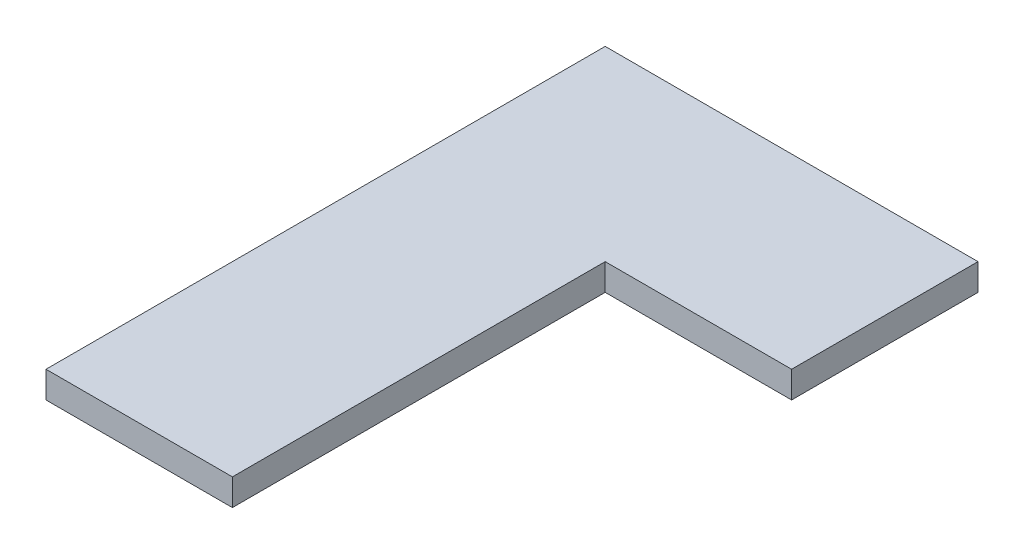
ISO-10303-21;
HEADER;
FILE_DESCRIPTION(('STEP AP214'),'2;1');
FILE_NAME('part.step','',(''),(''),'','','');
FILE_SCHEMA(('AUTOMOTIVE_DESIGN { 1 0 10303 214 1 1 1 1 }'));
ENDSEC;
DATA;
#1=APPLICATION_CONTEXT('core data for automotive mechanical design processes');
#2=APPLICATION_PROTOCOL_DEFINITION('international standard','automotive_design',2000,#1);
#3=PRODUCT_CONTEXT('',#1,'mechanical');
#4=PRODUCT('Part','Part','',(#3));
#5=PRODUCT_RELATED_PRODUCT_CATEGORY('part','',(#4));
#6=PRODUCT_DEFINITION_FORMATION('','',#4);
#7=PRODUCT_DEFINITION_CONTEXT('part definition',#1,'design');
#8=PRODUCT_DEFINITION('design','',#6,#7);
#9=PRODUCT_DEFINITION_SHAPE('','',#8);
#10=(LENGTH_UNIT() NAMED_UNIT(*) SI_UNIT(.MILLI.,.METRE.));
#11=(NAMED_UNIT(*) PLANE_ANGLE_UNIT() SI_UNIT($,.RADIAN.));
#12=(NAMED_UNIT(*) SI_UNIT($,.STERADIAN.) SOLID_ANGLE_UNIT());
#13=UNCERTAINTY_MEASURE_WITH_UNIT(LENGTH_MEASURE(1.E-05),#10,'distance_accuracy_value','');
#14=(GEOMETRIC_REPRESENTATION_CONTEXT(3) GLOBAL_UNCERTAINTY_ASSIGNED_CONTEXT((#13)) GLOBAL_UNIT_ASSIGNED_CONTEXT((#10,
#11,#12)) REPRESENTATION_CONTEXT('',''));
#15=CARTESIAN_POINT('',(0.,0.,0.));
#16=DIRECTION('',(0.,0.,1.));
#17=DIRECTION('',(1.,0.,0.));
#18=AXIS2_PLACEMENT_3D('',#15,#16,#17);
#19=CARTESIAN_POINT('',(-70.,10.,-105.));
#20=DIRECTION('',(1.,0.,0.));
#21=DIRECTION('',(0.,0.,-1.));
#22=AXIS2_PLACEMENT_3D('',#19,#20,#21);
#23=PLANE('',#22);
#24=DIRECTION('',(0.,0.,1.));
#25=VECTOR('',#24,1.);
#26=CARTESIAN_POINT('',(-70.,0.,-105.));
#27=LINE('',#26,#25);
#28=CARTESIAN_POINT('',(-70.,0.,-105.));
#29=VERTEX_POINT('',#28);
#30=CARTESIAN_POINT('',(-70.,0.,105.));
#31=VERTEX_POINT('',#30);
#32=EDGE_CURVE('E118',#29,#31,#27,.T.);
#33=ORIENTED_EDGE('',*,*,#32,.T.);
#34=DIRECTION('',(0.,-1.,0.));
#35=VECTOR('',#34,1.);
#36=CARTESIAN_POINT('',(-70.,10.,105.));
#37=LINE('',#36,#35);
#38=CARTESIAN_POINT('',(-70.,10.,105.));
#39=VERTEX_POINT('',#38);
#40=EDGE_CURVE('E11',#39,#31,#37,.T.);
#41=ORIENTED_EDGE('',*,*,#40,.F.);
#42=DIRECTION('',(0.,0.,1.));
#43=VECTOR('',#42,1.);
#44=CARTESIAN_POINT('',(-70.,10.,-105.));
#45=LINE('',#44,#43);
#46=CARTESIAN_POINT('',(-70.,10.,-105.));
#47=VERTEX_POINT('',#46);
#48=EDGE_CURVE('E128',#47,#39,#45,.T.);
#49=ORIENTED_EDGE('',*,*,#48,.F.);
#50=DIRECTION('',(0.,-1.,0.));
#51=VECTOR('',#50,1.);
#52=CARTESIAN_POINT('',(-70.,10.,-105.));
#53=LINE('',#52,#51);
#54=EDGE_CURVE('E114',#47,#29,#53,.T.);
#55=ORIENTED_EDGE('',*,*,#54,.T.);
#56=EDGE_LOOP('',(#33,#41,#49,#55));
#57=FACE_BOUND('',#56,.T.);
#58=ADVANCED_FACE('F34',(#57),#23,.F.);
#59=CARTESIAN_POINT('',(-70.,10.,105.));
#60=DIRECTION('',(0.,0.,-1.));
#61=DIRECTION('',(-1.,0.,0.));
#62=AXIS2_PLACEMENT_3D('',#59,#60,#61);
#63=PLANE('',#62);
#64=DIRECTION('',(1.,0.,0.));
#65=VECTOR('',#64,1.);
#66=CARTESIAN_POINT('',(-70.,0.,105.));
#67=LINE('',#66,#65);
#68=CARTESIAN_POINT('',(0.,0.,105.));
#69=VERTEX_POINT('',#68);
#70=EDGE_CURVE('E121',#31,#69,#67,.T.);
#71=ORIENTED_EDGE('',*,*,#70,.T.);
#72=DIRECTION('',(0.,-1.,0.));
#73=VECTOR('',#72,1.);
#74=CARTESIAN_POINT('',(0.,10.,105.));
#75=LINE('',#74,#73);
#76=CARTESIAN_POINT('',(0.,10.,105.));
#77=VERTEX_POINT('',#76);
#78=EDGE_CURVE('E42',#77,#69,#75,.T.);
#79=ORIENTED_EDGE('',*,*,#78,.F.);
#80=DIRECTION('',(1.,0.,0.));
#81=VECTOR('',#80,1.);
#82=CARTESIAN_POINT('',(-70.,10.,105.));
#83=LINE('',#82,#81);
#84=EDGE_CURVE('E87',#39,#77,#83,.T.);
#85=ORIENTED_EDGE('',*,*,#84,.F.);
#86=ORIENTED_EDGE('',*,*,#40,.T.);
#87=EDGE_LOOP('',(#71,#79,#85,#86));
#88=FACE_BOUND('',#87,.T.);
#89=ADVANCED_FACE('F152',(#88),#63,.F.);
#90=CARTESIAN_POINT('',(0.,10.,105.));
#91=DIRECTION('',(-1.,0.,0.));
#92=DIRECTION('',(0.,0.,1.));
#93=AXIS2_PLACEMENT_3D('',#90,#91,#92);
#94=PLANE('',#93);
#95=DIRECTION('',(0.,0.,-1.));
#96=VECTOR('',#95,1.);
#97=CARTESIAN_POINT('',(0.,0.,105.));
#98=LINE('',#97,#96);
#99=CARTESIAN_POINT('',(0.,0.,-35.));
#100=VERTEX_POINT('',#99);
#101=EDGE_CURVE('E123',#69,#100,#98,.T.);
#102=ORIENTED_EDGE('',*,*,#101,.T.);
#103=DIRECTION('',(0.,-1.,0.));
#104=VECTOR('',#103,1.);
#105=CARTESIAN_POINT('',(0.,10.,-35.));
#106=LINE('',#105,#104);
#107=CARTESIAN_POINT('',(0.,10.,-35.));
#108=VERTEX_POINT('',#107);
#109=EDGE_CURVE('E109',#108,#100,#106,.T.);
#110=ORIENTED_EDGE('',*,*,#109,.F.);
#111=DIRECTION('',(0.,0.,-1.));
#112=VECTOR('',#111,1.);
#113=CARTESIAN_POINT('',(0.,10.,105.));
#114=LINE('',#113,#112);
#115=EDGE_CURVE('E100',#77,#108,#114,.T.);
#116=ORIENTED_EDGE('',*,*,#115,.F.);
#117=ORIENTED_EDGE('',*,*,#78,.T.);
#118=EDGE_LOOP('',(#102,#110,#116,#117));
#119=FACE_BOUND('',#118,.T.);
#120=ADVANCED_FACE('F134',(#119),#94,.F.);
#121=CARTESIAN_POINT('',(0.,10.,-35.));
#122=DIRECTION('',(0.,0.,-1.));
#123=DIRECTION('',(-1.,0.,0.));
#124=AXIS2_PLACEMENT_3D('',#121,#122,#123);
#125=PLANE('',#124);
#126=DIRECTION('',(1.,0.,0.));
#127=VECTOR('',#126,1.);
#128=CARTESIAN_POINT('',(0.,0.,-35.));
#129=LINE('',#128,#127);
#130=CARTESIAN_POINT('',(70.,0.,-35.));
#131=VERTEX_POINT('',#130);
#132=EDGE_CURVE('E108',#100,#131,#129,.T.);
#133=ORIENTED_EDGE('',*,*,#132,.T.);
#134=DIRECTION('',(0.,-1.,0.));
#135=VECTOR('',#134,1.);
#136=CARTESIAN_POINT('',(70.,10.,-35.));
#137=LINE('',#136,#135);
#138=CARTESIAN_POINT('',(70.,10.,-35.));
#139=VERTEX_POINT('',#138);
#140=EDGE_CURVE('E105',#139,#131,#137,.T.);
#141=ORIENTED_EDGE('',*,*,#140,.F.);
#142=DIRECTION('',(1.,0.,0.));
#143=VECTOR('',#142,1.);
#144=CARTESIAN_POINT('',(0.,10.,-35.));
#145=LINE('',#144,#143);
#146=EDGE_CURVE('E94',#108,#139,#145,.T.);
#147=ORIENTED_EDGE('',*,*,#146,.F.);
#148=ORIENTED_EDGE('',*,*,#109,.T.);
#149=EDGE_LOOP('',(#133,#141,#147,#148));
#150=FACE_BOUND('',#149,.T.);
#151=ADVANCED_FACE('F106',(#150),#125,.F.);
#152=CARTESIAN_POINT('',(70.,10.,-105.));
#153=DIRECTION('',(-1.,0.,0.));
#154=DIRECTION('',(0.,0.,1.));
#155=AXIS2_PLACEMENT_3D('',#152,#153,#154);
#156=PLANE('',#155);
#157=DIRECTION('',(0.,0.,-1.));
#158=VECTOR('',#157,1.);
#159=CARTESIAN_POINT('',(70.,0.,-105.));
#160=LINE('',#159,#158);
#161=CARTESIAN_POINT('',(70.,0.,-105.));
#162=VERTEX_POINT('',#161);
#163=EDGE_CURVE('E73',#131,#162,#160,.T.);
#164=ORIENTED_EDGE('',*,*,#163,.T.);
#165=DIRECTION('',(0.,-1.,0.));
#166=VECTOR('',#165,1.);
#167=CARTESIAN_POINT('',(70.,10.,-105.));
#168=LINE('',#167,#166);
#169=CARTESIAN_POINT('',(70.,10.,-105.));
#170=VERTEX_POINT('',#169);
#171=EDGE_CURVE('E110',#170,#162,#168,.T.);
#172=ORIENTED_EDGE('',*,*,#171,.F.);
#173=DIRECTION('',(0.,0.,-1.));
#174=VECTOR('',#173,1.);
#175=CARTESIAN_POINT('',(70.,10.,-105.));
#176=LINE('',#175,#174);
#177=EDGE_CURVE('E98',#139,#170,#176,.T.);
#178=ORIENTED_EDGE('',*,*,#177,.F.);
#179=ORIENTED_EDGE('',*,*,#140,.T.);
#180=EDGE_LOOP('',(#164,#172,#178,#179));
#181=FACE_BOUND('',#180,.T.);
#182=ADVANCED_FACE('F112',(#181),#156,.F.);
#183=CARTESIAN_POINT('',(70.,10.,-105.));
#184=DIRECTION('',(0.,0.,1.));
#185=DIRECTION('',(1.,0.,0.));
#186=AXIS2_PLACEMENT_3D('',#183,#184,#185);
#187=PLANE('',#186);
#188=DIRECTION('',(-1.,0.,0.));
#189=VECTOR('',#188,1.);
#190=CARTESIAN_POINT('',(70.,0.,-105.));
#191=LINE('',#190,#189);
#192=EDGE_CURVE('E79',#162,#29,#191,.T.);
#193=ORIENTED_EDGE('',*,*,#192,.T.);
#194=ORIENTED_EDGE('',*,*,#54,.F.);
#195=DIRECTION('',(-1.,0.,0.));
#196=VECTOR('',#195,1.);
#197=CARTESIAN_POINT('',(70.,10.,-105.));
#198=LINE('',#197,#196);
#199=EDGE_CURVE('E50',#170,#47,#198,.T.);
#200=ORIENTED_EDGE('',*,*,#199,.F.);
#201=ORIENTED_EDGE('',*,*,#171,.T.);
#202=EDGE_LOOP('',(#193,#194,#200,#201));
#203=FACE_BOUND('',#202,.T.);
#204=ADVANCED_FACE('F141',(#203),#187,.F.);
#205=CARTESIAN_POINT('',(0.,10.,0.));
#206=DIRECTION('',(0.,1.,0.));
#207=DIRECTION('',(0.,0.,1.));
#208=AXIS2_PLACEMENT_3D('',#205,#206,#207);
#209=PLANE('',#208);
#210=ORIENTED_EDGE('',*,*,#48,.T.);
#211=ORIENTED_EDGE('',*,*,#84,.T.);
#212=ORIENTED_EDGE('',*,*,#115,.T.);
#213=ORIENTED_EDGE('',*,*,#146,.T.);
#214=ORIENTED_EDGE('',*,*,#177,.T.);
#215=ORIENTED_EDGE('',*,*,#199,.T.);
#216=EDGE_LOOP('',(#210,#211,#212,#213,#214,#215));
#217=FACE_BOUND('',#216,.T.);
#218=ADVANCED_FACE('F96',(#217),#209,.T.);
#219=CARTESIAN_POINT('',(0.,0.,0.));
#220=DIRECTION('',(0.,1.,0.));
#221=DIRECTION('',(0.,0.,1.));
#222=AXIS2_PLACEMENT_3D('',#219,#220,#221);
#223=PLANE('',#222);
#224=ORIENTED_EDGE('',*,*,#32,.F.);
#225=ORIENTED_EDGE('',*,*,#192,.F.);
#226=ORIENTED_EDGE('',*,*,#163,.F.);
#227=ORIENTED_EDGE('',*,*,#132,.F.);
#228=ORIENTED_EDGE('',*,*,#101,.F.);
#229=ORIENTED_EDGE('',*,*,#70,.F.);
#230=EDGE_LOOP('',(#224,#225,#226,#227,#228,#229));
#231=FACE_BOUND('',#230,.T.);
#232=ADVANCED_FACE('F137',(#231),#223,.F.);
#233=CLOSED_SHELL('',(#58,#89,#120,#151,#182,#204,#218,#232));
#234=MANIFOLD_SOLID_BREP('B2',#233);
#235=ADVANCED_BREP_SHAPE_REPRESENTATION('',(#18,#234),#14);
#236=SHAPE_DEFINITION_REPRESENTATION(#9,#235);
ENDSEC;
END-ISO-10303-21;
